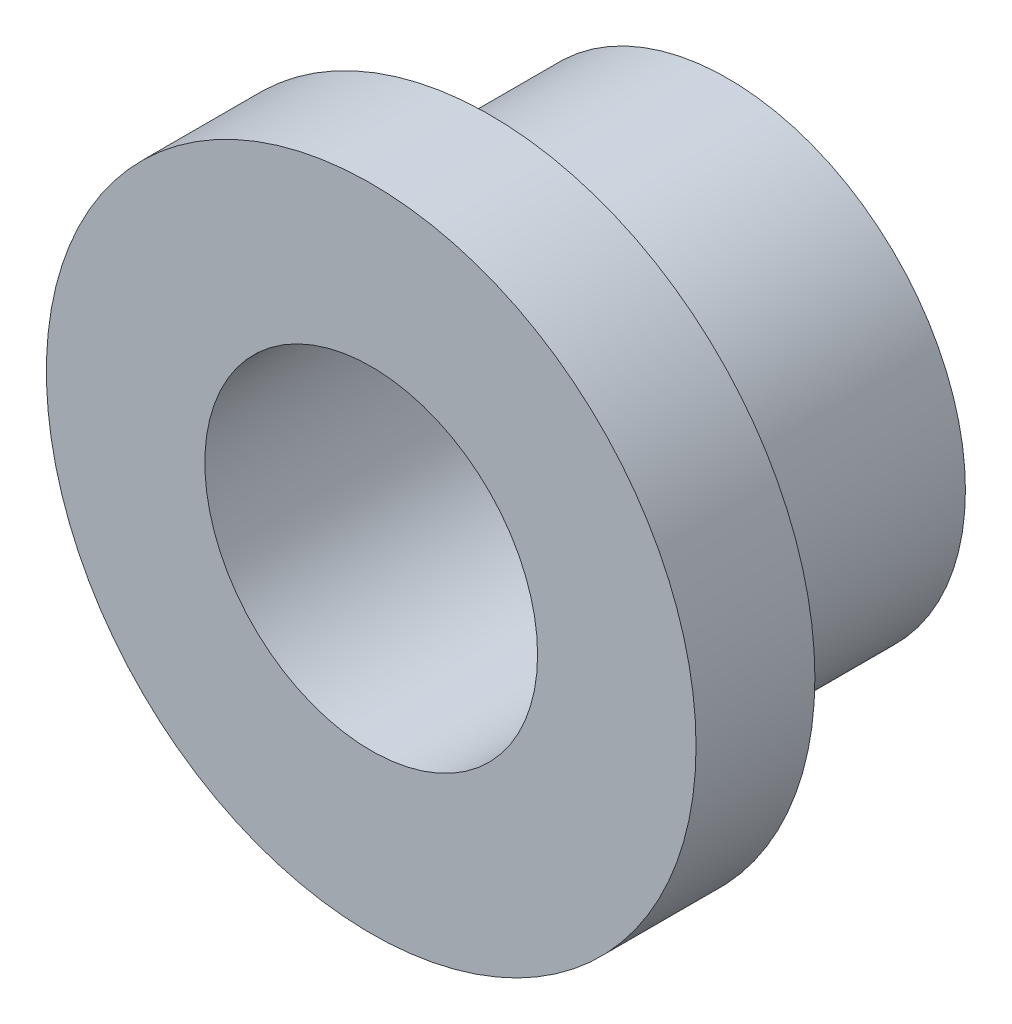
ISO-10303-21;
HEADER;
FILE_DESCRIPTION(('STEP AP214'),'2;1');
FILE_NAME('part.step','',(''),(''),'','','');
FILE_SCHEMA(('AUTOMOTIVE_DESIGN { 1 0 10303 214 1 1 1 1 }'));
ENDSEC;
DATA;
#1=APPLICATION_CONTEXT('core data for automotive mechanical design processes');
#2=APPLICATION_PROTOCOL_DEFINITION('international standard','automotive_design',2000,#1);
#3=PRODUCT_CONTEXT('',#1,'mechanical');
#4=PRODUCT('Part','Part','',(#3));
#5=PRODUCT_RELATED_PRODUCT_CATEGORY('part','',(#4));
#6=PRODUCT_DEFINITION_FORMATION('','',#4);
#7=PRODUCT_DEFINITION_CONTEXT('part definition',#1,'design');
#8=PRODUCT_DEFINITION('design','',#6,#7);
#9=PRODUCT_DEFINITION_SHAPE('','',#8);
#10=(LENGTH_UNIT() NAMED_UNIT(*) SI_UNIT(.MILLI.,.METRE.));
#11=(NAMED_UNIT(*) PLANE_ANGLE_UNIT() SI_UNIT($,.RADIAN.));
#12=(NAMED_UNIT(*) SI_UNIT($,.STERADIAN.) SOLID_ANGLE_UNIT());
#13=UNCERTAINTY_MEASURE_WITH_UNIT(LENGTH_MEASURE(1.E-05),#10,'distance_accuracy_value','');
#14=(GEOMETRIC_REPRESENTATION_CONTEXT(3) GLOBAL_UNCERTAINTY_ASSIGNED_CONTEXT((#13)) GLOBAL_UNIT_ASSIGNED_CONTEXT((#10,
#11,#12)) REPRESENTATION_CONTEXT('',''));
#15=CARTESIAN_POINT('',(0.,0.,0.));
#16=DIRECTION('',(0.,0.,1.));
#17=DIRECTION('',(1.,0.,0.));
#18=AXIS2_PLACEMENT_3D('',#15,#16,#17);
#19=CARTESIAN_POINT('',(0.,0.,8.03045048720723));
#20=DIRECTION('',(0.,0.,1.));
#21=DIRECTION('',(1.,0.,0.));
#22=AXIS2_PLACEMENT_3D('',#19,#20,#21);
#23=CYLINDRICAL_SURFACE('',#22,2.1);
#24=CARTESIAN_POINT('',(0.,0.,-4.5));
#25=DIRECTION('',(0.,0.,1.));
#26=DIRECTION('',(1.,0.,0.));
#27=AXIS2_PLACEMENT_3D('',#24,#25,#26);
#28=CIRCLE('',#27,2.1);
#29=CARTESIAN_POINT('',(2.1,0.,-4.5));
#30=VERTEX_POINT('',#29);
#31=EDGE_CURVE('E52',#30,#30,#28,.T.);
#32=ORIENTED_EDGE('',*,*,#31,.F.);
#33=EDGE_LOOP('',(#32));
#34=FACE_BOUND('',#33,.T.);
#35=CARTESIAN_POINT('',(0.,0.,0.));
#36=DIRECTION('',(0.,0.,1.));
#37=DIRECTION('',(1.,0.,0.));
#38=AXIS2_PLACEMENT_3D('',#35,#36,#37);
#39=CIRCLE('',#38,2.1);
#40=CARTESIAN_POINT('',(2.1,0.,0.));
#41=VERTEX_POINT('',#40);
#42=EDGE_CURVE('E10',#41,#41,#39,.T.);
#43=ORIENTED_EDGE('',*,*,#42,.T.);
#44=EDGE_LOOP('',(#43));
#45=FACE_BOUND('',#44,.T.);
#46=ADVANCED_FACE('F30',(#34,#45),#23,.F.);
#47=CARTESIAN_POINT('',(0.,2.1,0.));
#48=DIRECTION('',(0.,0.,-1.));
#49=DIRECTION('',(-1.,0.,0.));
#50=AXIS2_PLACEMENT_3D('',#47,#48,#49);
#51=PLANE('',#50);
#52=ORIENTED_EDGE('',*,*,#42,.F.);
#53=EDGE_LOOP('',(#52));
#54=FACE_BOUND('',#53,.T.);
#55=CARTESIAN_POINT('',(0.,0.,0.));
#56=DIRECTION('',(0.,0.,1.));
#57=DIRECTION('',(1.,0.,0.));
#58=AXIS2_PLACEMENT_3D('',#55,#56,#57);
#59=CIRCLE('',#58,4.1);
#60=CARTESIAN_POINT('',(4.1,0.,0.));
#61=VERTEX_POINT('',#60);
#62=EDGE_CURVE('E36',#61,#61,#59,.T.);
#63=ORIENTED_EDGE('',*,*,#62,.T.);
#64=EDGE_LOOP('',(#63));
#65=FACE_BOUND('',#64,.T.);
#66=ADVANCED_FACE('F59',(#54,#65),#51,.F.);
#67=CARTESIAN_POINT('',(0.,0.,8.03045048720723));
#68=DIRECTION('',(0.,0.,1.));
#69=DIRECTION('',(1.,0.,0.));
#70=AXIS2_PLACEMENT_3D('',#67,#68,#69);
#71=CYLINDRICAL_SURFACE('',#70,4.1);
#72=ORIENTED_EDGE('',*,*,#62,.F.);
#73=EDGE_LOOP('',(#72));
#74=FACE_BOUND('',#73,.T.);
#75=CARTESIAN_POINT('',(0.,0.,-1.5));
#76=DIRECTION('',(0.,0.,1.));
#77=DIRECTION('',(1.,0.,0.));
#78=AXIS2_PLACEMENT_3D('',#75,#76,#77);
#79=CIRCLE('',#78,4.1);
#80=CARTESIAN_POINT('',(4.1,0.,-1.5));
#81=VERTEX_POINT('',#80);
#82=EDGE_CURVE('E40',#81,#81,#79,.T.);
#83=ORIENTED_EDGE('',*,*,#82,.T.);
#84=EDGE_LOOP('',(#83));
#85=FACE_BOUND('',#84,.T.);
#86=ADVANCED_FACE('F63',(#74,#85),#71,.T.);
#87=CARTESIAN_POINT('',(0.,4.1,-1.5));
#88=DIRECTION('',(0.,0.,1.));
#89=DIRECTION('',(1.,0.,0.));
#90=AXIS2_PLACEMENT_3D('',#87,#88,#89);
#91=PLANE('',#90);
#92=ORIENTED_EDGE('',*,*,#82,.F.);
#93=EDGE_LOOP('',(#92));
#94=FACE_BOUND('',#93,.T.);
#95=CARTESIAN_POINT('',(0.,0.,-1.5));
#96=DIRECTION('',(0.,0.,1.));
#97=DIRECTION('',(1.,0.,0.));
#98=AXIS2_PLACEMENT_3D('',#95,#96,#97);
#99=CIRCLE('',#98,3.);
#100=CARTESIAN_POINT('',(3.,0.,-1.5));
#101=VERTEX_POINT('',#100);
#102=EDGE_CURVE('E44',#101,#101,#99,.T.);
#103=ORIENTED_EDGE('',*,*,#102,.T.);
#104=EDGE_LOOP('',(#103));
#105=FACE_BOUND('',#104,.T.);
#106=ADVANCED_FACE('F68',(#94,#105),#91,.F.);
#107=CARTESIAN_POINT('',(0.,0.,8.03045048720723));
#108=DIRECTION('',(0.,0.,1.));
#109=DIRECTION('',(1.,0.,0.));
#110=AXIS2_PLACEMENT_3D('',#107,#108,#109);
#111=CYLINDRICAL_SURFACE('',#110,3.);
#112=ORIENTED_EDGE('',*,*,#102,.F.);
#113=EDGE_LOOP('',(#112));
#114=FACE_BOUND('',#113,.T.);
#115=CARTESIAN_POINT('',(0.,0.,-4.5));
#116=DIRECTION('',(0.,0.,1.));
#117=DIRECTION('',(1.,0.,0.));
#118=AXIS2_PLACEMENT_3D('',#115,#116,#117);
#119=CIRCLE('',#118,3.);
#120=CARTESIAN_POINT('',(3.,0.,-4.5));
#121=VERTEX_POINT('',#120);
#122=EDGE_CURVE('E49',#121,#121,#119,.T.);
#123=ORIENTED_EDGE('',*,*,#122,.T.);
#124=EDGE_LOOP('',(#123));
#125=FACE_BOUND('',#124,.T.);
#126=ADVANCED_FACE('F74',(#114,#125),#111,.T.);
#127=CARTESIAN_POINT('',(0.,3.,-4.5));
#128=DIRECTION('',(0.,0.,1.));
#129=DIRECTION('',(1.,0.,0.));
#130=AXIS2_PLACEMENT_3D('',#127,#128,#129);
#131=PLANE('',#130);
#132=ORIENTED_EDGE('',*,*,#122,.F.);
#133=EDGE_LOOP('',(#132));
#134=FACE_BOUND('',#133,.T.);
#135=ORIENTED_EDGE('',*,*,#31,.T.);
#136=EDGE_LOOP('',(#135));
#137=FACE_BOUND('',#136,.T.);
#138=ADVANCED_FACE('F56',(#134,#137),#131,.F.);
#139=CLOSED_SHELL('',(#46,#66,#86,#106,#126,#138));
#140=MANIFOLD_SOLID_BREP('B2',#139);
#141=ADVANCED_BREP_SHAPE_REPRESENTATION('',(#18,#140),#14);
#142=SHAPE_DEFINITION_REPRESENTATION(#9,#141);
ENDSEC;
END-ISO-10303-21;
